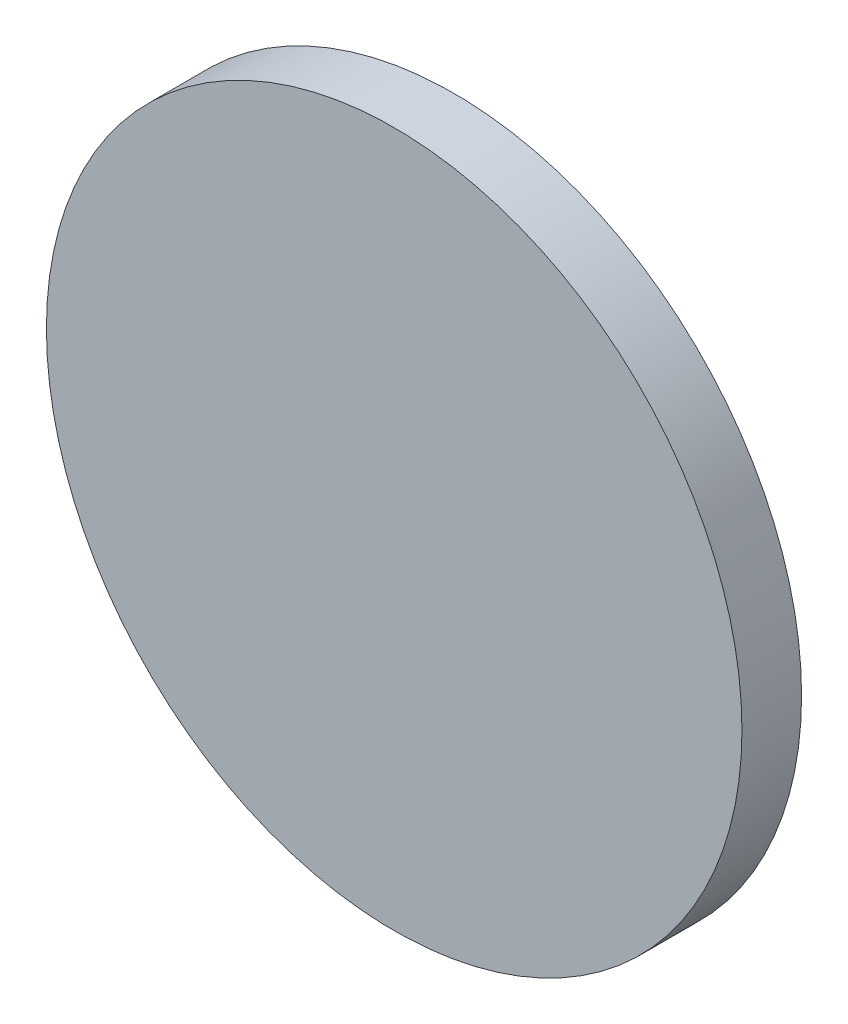
ISO-10303-21;
HEADER;
FILE_DESCRIPTION(('STEP AP214'),'2;1');
FILE_NAME('part.step','',(''),(''),'','','');
FILE_SCHEMA(('AUTOMOTIVE_DESIGN { 1 0 10303 214 1 1 1 1 }'));
ENDSEC;
DATA;
#1=APPLICATION_CONTEXT('core data for automotive mechanical design processes');
#2=APPLICATION_PROTOCOL_DEFINITION('international standard','automotive_design',2000,#1);
#3=PRODUCT_CONTEXT('',#1,'mechanical');
#4=PRODUCT('Part','Part','',(#3));
#5=PRODUCT_RELATED_PRODUCT_CATEGORY('part','',(#4));
#6=PRODUCT_DEFINITION_FORMATION('','',#4);
#7=PRODUCT_DEFINITION_CONTEXT('part definition',#1,'design');
#8=PRODUCT_DEFINITION('design','',#6,#7);
#9=PRODUCT_DEFINITION_SHAPE('','',#8);
#10=(LENGTH_UNIT() NAMED_UNIT(*) SI_UNIT(.MILLI.,.METRE.));
#11=(NAMED_UNIT(*) PLANE_ANGLE_UNIT() SI_UNIT($,.RADIAN.));
#12=(NAMED_UNIT(*) SI_UNIT($,.STERADIAN.) SOLID_ANGLE_UNIT());
#13=UNCERTAINTY_MEASURE_WITH_UNIT(LENGTH_MEASURE(1.E-05),#10,'distance_accuracy_value','');
#14=(GEOMETRIC_REPRESENTATION_CONTEXT(3) GLOBAL_UNCERTAINTY_ASSIGNED_CONTEXT((#13)) GLOBAL_UNIT_ASSIGNED_CONTEXT((#10,
#11,#12)) REPRESENTATION_CONTEXT('',''));
#15=CARTESIAN_POINT('',(0.,0.,0.));
#16=DIRECTION('',(0.,0.,1.));
#17=DIRECTION('',(1.,0.,0.));
#18=AXIS2_PLACEMENT_3D('',#15,#16,#17);
#19=CARTESIAN_POINT('',(11.90008,10.400000014875,0.));
#20=DIRECTION('',(0.,0.,-1.));
#21=DIRECTION('',(-1.,0.,0.));
#22=AXIS2_PLACEMENT_3D('',#19,#20,#21);
#23=PLANE('',#22);
#24=CARTESIAN_POINT('',(11.90008,10.400000014875,0.));
#25=DIRECTION('',(0.,0.,1.));
#26=DIRECTION('',(1.,0.,0.));
#27=AXIS2_PLACEMENT_3D('',#24,#25,#26);
#28=CIRCLE('',#27,0.200024667);
#29=CARTESIAN_POINT('',(12.100104667,10.400000014875,0.));
#30=VERTEX_POINT('',#29);
#31=EDGE_CURVE('E18',#30,#30,#28,.T.);
#32=ORIENTED_EDGE('',*,*,#31,.F.);
#33=EDGE_LOOP('',(#32));
#34=FACE_BOUND('',#33,.T.);
#35=ADVANCED_FACE('F15',(#34),#23,.T.);
#36=CARTESIAN_POINT('',(11.90008,10.400000014875,0.));
#37=DIRECTION('',(0.,0.,1.));
#38=DIRECTION('',(1.,0.,0.));
#39=AXIS2_PLACEMENT_3D('',#36,#37,#38);
#40=CYLINDRICAL_SURFACE('',#39,0.200024667);
#41=CARTESIAN_POINT('',(11.90008,10.400000014875,0.03429));
#42=DIRECTION('',(0.,0.,1.));
#43=DIRECTION('',(1.,0.,0.));
#44=AXIS2_PLACEMENT_3D('',#41,#42,#43);
#45=CIRCLE('',#44,0.200024667);
#46=CARTESIAN_POINT('',(12.100104667,10.400000014875,0.03429));
#47=VERTEX_POINT('',#46);
#48=EDGE_CURVE('E10',#47,#47,#45,.T.);
#49=ORIENTED_EDGE('',*,*,#48,.F.);
#50=EDGE_LOOP('',(#49));
#51=FACE_BOUND('',#50,.T.);
#52=ORIENTED_EDGE('',*,*,#31,.T.);
#53=EDGE_LOOP('',(#52));
#54=FACE_BOUND('',#53,.T.);
#55=ADVANCED_FACE('F27',(#51,#54),#40,.T.);
#56=CARTESIAN_POINT('',(11.90008,10.400000014875,0.03429));
#57=DIRECTION('',(0.,0.,1.));
#58=DIRECTION('',(1.,0.,0.));
#59=AXIS2_PLACEMENT_3D('',#56,#57,#58);
#60=PLANE('',#59);
#61=ORIENTED_EDGE('',*,*,#48,.T.);
#62=EDGE_LOOP('',(#61));
#63=FACE_BOUND('',#62,.T.);
#64=ADVANCED_FACE('F34',(#63),#60,.T.);
#65=CLOSED_SHELL('',(#35,#55,#64));
#66=MANIFOLD_SOLID_BREP('B1',#65);
#67=ADVANCED_BREP_SHAPE_REPRESENTATION('',(#18,#66),#14);
#68=SHAPE_DEFINITION_REPRESENTATION(#9,#67);
ENDSEC;
END-ISO-10303-21;
